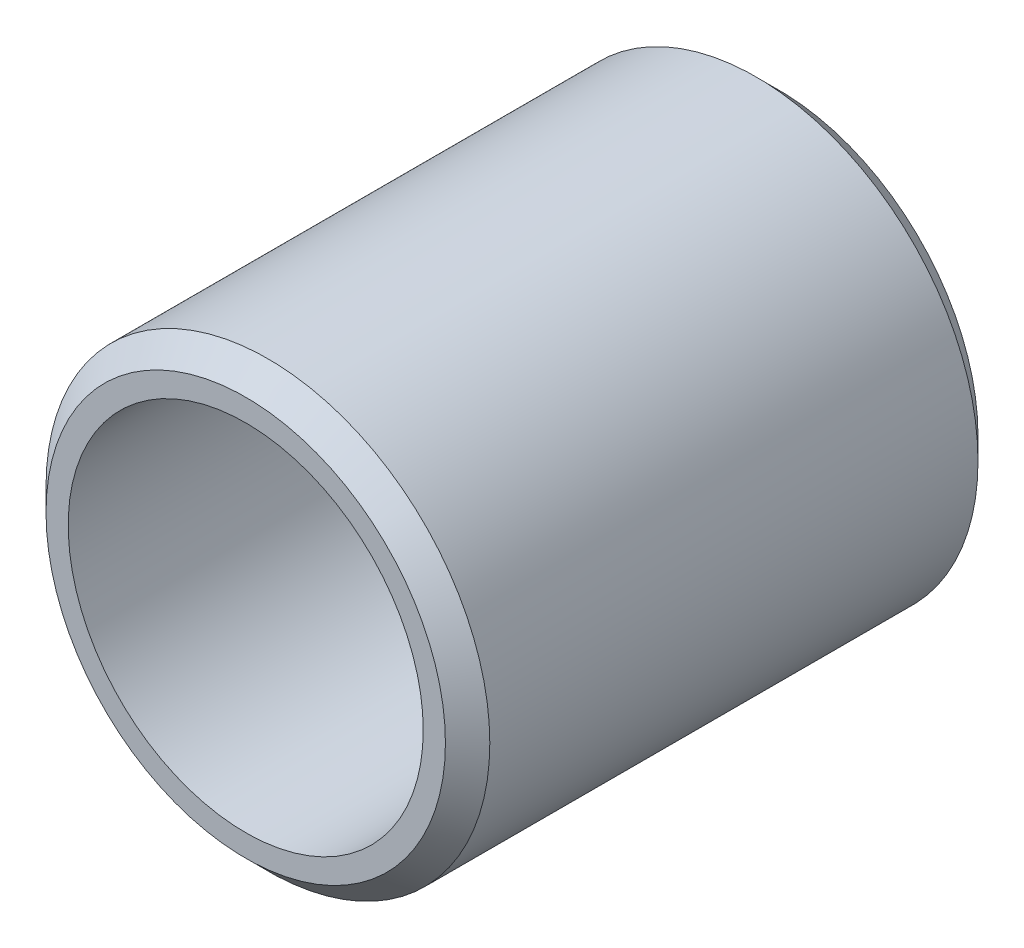
ISO-10303-21;
HEADER;
FILE_DESCRIPTION(('STEP AP214'),'2;1');
FILE_NAME('part.step','',(''),(''),'','','');
FILE_SCHEMA(('AUTOMOTIVE_DESIGN { 1 0 10303 214 1 1 1 1 }'));
ENDSEC;
DATA;
#1=APPLICATION_CONTEXT('core data for automotive mechanical design processes');
#2=APPLICATION_PROTOCOL_DEFINITION('international standard','automotive_design',2000,#1);
#3=PRODUCT_CONTEXT('',#1,'mechanical');
#4=PRODUCT('Part','Part','',(#3));
#5=PRODUCT_RELATED_PRODUCT_CATEGORY('part','',(#4));
#6=PRODUCT_DEFINITION_FORMATION('','',#4);
#7=PRODUCT_DEFINITION_CONTEXT('part definition',#1,'design');
#8=PRODUCT_DEFINITION('design','',#6,#7);
#9=PRODUCT_DEFINITION_SHAPE('','',#8);
#10=(LENGTH_UNIT() NAMED_UNIT(*) SI_UNIT(.MILLI.,.METRE.));
#11=(NAMED_UNIT(*) PLANE_ANGLE_UNIT() SI_UNIT($,.RADIAN.));
#12=(NAMED_UNIT(*) SI_UNIT($,.STERADIAN.) SOLID_ANGLE_UNIT());
#13=UNCERTAINTY_MEASURE_WITH_UNIT(LENGTH_MEASURE(1.E-05),#10,'distance_accuracy_value','');
#14=(GEOMETRIC_REPRESENTATION_CONTEXT(3) GLOBAL_UNCERTAINTY_ASSIGNED_CONTEXT((#13)) GLOBAL_UNIT_ASSIGNED_CONTEXT((#10,
#11,#12)) REPRESENTATION_CONTEXT('',''));
#15=CARTESIAN_POINT('',(0.,0.,0.));
#16=DIRECTION('',(0.,0.,1.));
#17=DIRECTION('',(1.,0.,0.));
#18=AXIS2_PLACEMENT_3D('',#15,#16,#17);
#19=CARTESIAN_POINT('',(0.,0.,11.9999999999999));
#20=DIRECTION('',(0.,0.,0.999999999999996));
#21=DIRECTION('',(0.999999999999998,0.,0.));
#22=AXIS2_PLACEMENT_3D('',#19,#20,#21);
#23=PLANE('',#22);
#24=CARTESIAN_POINT('',(0.,0.,11.9999999999999));
#25=DIRECTION('',(0.,0.,0.999999999999996));
#26=DIRECTION('',(0.999999999999998,0.,0.));
#27=AXIS2_PLACEMENT_3D('',#24,#25,#26);
#28=CIRCLE('',#27,4.5);
#29=CARTESIAN_POINT('',(4.49999999999999,0.,11.9999999999999));
#30=VERTEX_POINT('',#29);
#31=EDGE_CURVE('E10',#30,#30,#28,.T.);
#32=ORIENTED_EDGE('',*,*,#31,.T.);
#33=EDGE_LOOP('',(#32));
#34=FACE_BOUND('',#33,.T.);
#35=CARTESIAN_POINT('',(0.,0.,11.9999999999999));
#36=DIRECTION('',(0.,0.,0.999999999999996));
#37=DIRECTION('',(0.999999999999998,0.,0.));
#38=AXIS2_PLACEMENT_3D('',#35,#36,#37);
#39=CIRCLE('',#38,4.);
#40=CARTESIAN_POINT('',(3.99999999999999,0.,11.9999999999999));
#41=VERTEX_POINT('',#40);
#42=EDGE_CURVE('E52',#41,#41,#39,.T.);
#43=ORIENTED_EDGE('',*,*,#42,.F.);
#44=EDGE_LOOP('',(#43));
#45=FACE_BOUND('',#44,.T.);
#46=ADVANCED_FACE('F32',(#34,#45),#23,.T.);
#47=CARTESIAN_POINT('',(0.,0.,0.));
#48=DIRECTION('',(0.,0.,0.999999999999996));
#49=DIRECTION('',(0.999999999999998,0.,0.));
#50=AXIS2_PLACEMENT_3D('',#47,#48,#49);
#51=PLANE('',#50);
#52=CARTESIAN_POINT('',(0.,0.,0.));
#53=DIRECTION('',(0.,0.,0.999999999999996));
#54=DIRECTION('',(0.999999999999998,0.,0.));
#55=AXIS2_PLACEMENT_3D('',#52,#53,#54);
#56=CIRCLE('',#55,4.5);
#57=CARTESIAN_POINT('',(4.49999999999999,0.,0.));
#58=VERTEX_POINT('',#57);
#59=EDGE_CURVE('E39',#58,#58,#56,.F.);
#60=ORIENTED_EDGE('',*,*,#59,.T.);
#61=EDGE_LOOP('',(#60));
#62=FACE_BOUND('',#61,.T.);
#63=CARTESIAN_POINT('',(0.,0.,0.));
#64=DIRECTION('',(0.,0.,0.999999999999996));
#65=DIRECTION('',(0.999999999999998,0.,0.));
#66=AXIS2_PLACEMENT_3D('',#63,#64,#65);
#67=CIRCLE('',#66,4.);
#68=CARTESIAN_POINT('',(3.99999999999999,0.,0.));
#69=VERTEX_POINT('',#68);
#70=EDGE_CURVE('E53',#69,#69,#67,.T.);
#71=ORIENTED_EDGE('',*,*,#70,.T.);
#72=EDGE_LOOP('',(#71));
#73=FACE_BOUND('',#72,.T.);
#74=ADVANCED_FACE('F63',(#62,#73),#51,.F.);
#75=CARTESIAN_POINT('',(0.,0.,11.9999999999999));
#76=DIRECTION('',(0.,0.,-0.999999999999996));
#77=DIRECTION('',(-0.999999999999998,0.,0.));
#78=AXIS2_PLACEMENT_3D('',#75,#76,#77);
#79=CYLINDRICAL_SURFACE('',#78,5.);
#80=CARTESIAN_POINT('',(0.,0.,0.499999999999993));
#81=DIRECTION('',(0.,0.,0.999999999999996));
#82=DIRECTION('',(0.999999999999998,0.,0.));
#83=AXIS2_PLACEMENT_3D('',#80,#81,#82);
#84=CIRCLE('',#83,5.);
#85=CARTESIAN_POINT('',(4.99999999999999,0.,0.499999999999993));
#86=VERTEX_POINT('',#85);
#87=EDGE_CURVE('E43',#86,#86,#84,.T.);
#88=ORIENTED_EDGE('',*,*,#87,.T.);
#89=EDGE_LOOP('',(#88));
#90=FACE_BOUND('',#89,.T.);
#91=CARTESIAN_POINT('',(0.,0.,11.4999999999999));
#92=DIRECTION('',(0.,0.,0.999999999999996));
#93=DIRECTION('',(0.999999999999998,0.,0.));
#94=AXIS2_PLACEMENT_3D('',#91,#92,#93);
#95=CIRCLE('',#94,5.);
#96=CARTESIAN_POINT('',(4.99999999999999,0.,11.4999999999999));
#97=VERTEX_POINT('',#96);
#98=EDGE_CURVE('E47',#97,#97,#95,.F.);
#99=ORIENTED_EDGE('',*,*,#98,.T.);
#100=EDGE_LOOP('',(#99));
#101=FACE_BOUND('',#100,.T.);
#102=ADVANCED_FACE('F68',(#90,#101),#79,.T.);
#103=CARTESIAN_POINT('',(0.,0.,11.9999999999999));
#104=DIRECTION('',(0.,0.,-0.999999999999996));
#105=DIRECTION('',(-0.999999999999998,0.,0.));
#106=AXIS2_PLACEMENT_3D('',#103,#104,#105);
#107=CYLINDRICAL_SURFACE('',#106,4.);
#108=ORIENTED_EDGE('',*,*,#42,.T.);
#109=EDGE_LOOP('',(#108));
#110=FACE_BOUND('',#109,.T.);
#111=ORIENTED_EDGE('',*,*,#70,.F.);
#112=EDGE_LOOP('',(#111));
#113=FACE_BOUND('',#112,.T.);
#114=ADVANCED_FACE('F59',(#110,#113),#107,.F.);
#115=CARTESIAN_POINT('',(0.,0.,0.499999999999993));
#116=DIRECTION('',(0.,0.,0.999999999999996));
#117=DIRECTION('',(0.999999999999998,0.,0.));
#118=AXIS2_PLACEMENT_3D('',#115,#116,#117);
#119=CONICAL_SURFACE('',#118,5.,0.785398163397449);
#120=ORIENTED_EDGE('',*,*,#59,.F.);
#121=EDGE_LOOP('',(#120));
#122=FACE_BOUND('',#121,.T.);
#123=ORIENTED_EDGE('',*,*,#87,.F.);
#124=EDGE_LOOP('',(#123));
#125=FACE_BOUND('',#124,.T.);
#126=ADVANCED_FACE('F74',(#122,#125),#119,.T.);
#127=CARTESIAN_POINT('',(0.,0.,11.9999999999999));
#128=DIRECTION('',(0.,0.,-0.999999999999996));
#129=DIRECTION('',(-0.999999999999998,0.,0.));
#130=AXIS2_PLACEMENT_3D('',#127,#128,#129);
#131=CONICAL_SURFACE('',#130,4.5,0.785398163397446);
#132=ORIENTED_EDGE('',*,*,#98,.F.);
#133=EDGE_LOOP('',(#132));
#134=FACE_BOUND('',#133,.T.);
#135=ORIENTED_EDGE('',*,*,#31,.F.);
#136=EDGE_LOOP('',(#135));
#137=FACE_BOUND('',#136,.T.);
#138=ADVANCED_FACE('F34',(#134,#137),#131,.T.);
#139=CLOSED_SHELL('',(#46,#74,#102,#114,#126,#138));
#140=MANIFOLD_SOLID_BREP('B2',#139);
#141=ADVANCED_BREP_SHAPE_REPRESENTATION('',(#18,#140),#14);
#142=SHAPE_DEFINITION_REPRESENTATION(#9,#141);
ENDSEC;
END-ISO-10303-21;
